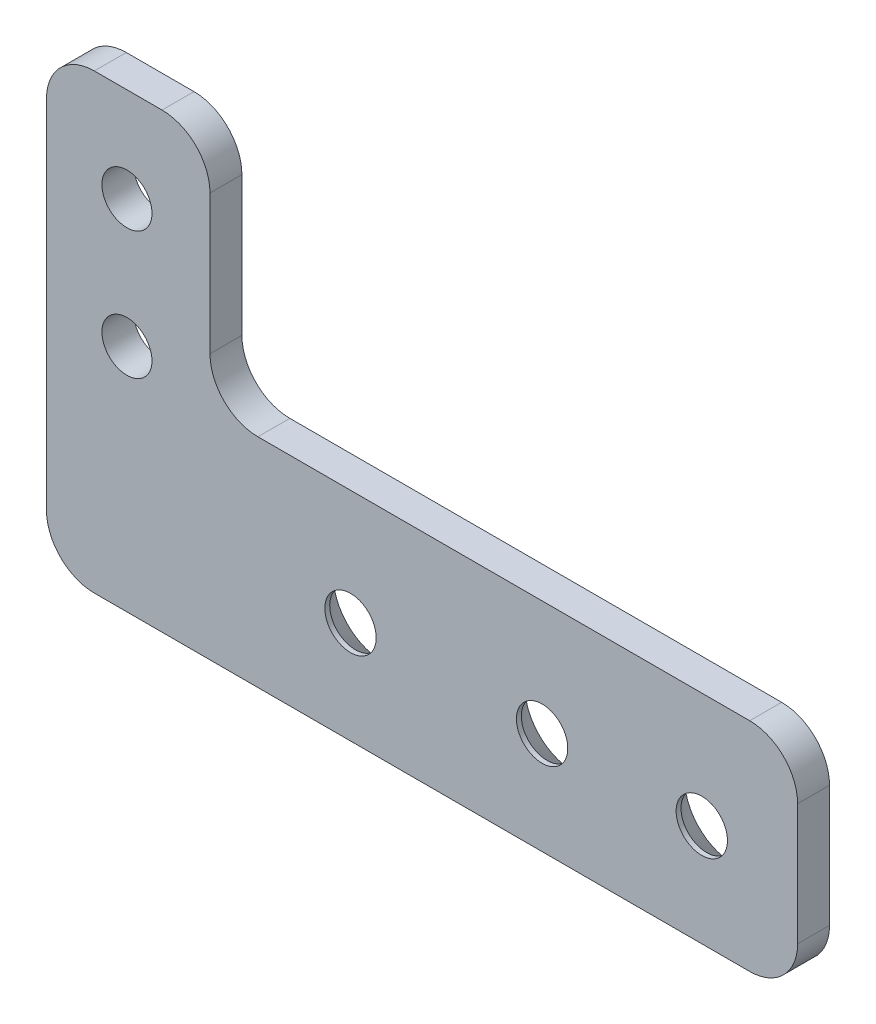
ISO-10303-21;
HEADER;
FILE_DESCRIPTION(('STEP AP214'),'2;1');
FILE_NAME('part.step','',(''),(''),'','','');
FILE_SCHEMA(('AUTOMOTIVE_DESIGN { 1 0 10303 214 1 1 1 1 }'));
ENDSEC;
DATA;
#1=APPLICATION_CONTEXT('core data for automotive mechanical design processes');
#2=APPLICATION_PROTOCOL_DEFINITION('international standard','automotive_design',2000,#1);
#3=PRODUCT_CONTEXT('',#1,'mechanical');
#4=PRODUCT('Part','Part','',(#3));
#5=PRODUCT_RELATED_PRODUCT_CATEGORY('part','',(#4));
#6=PRODUCT_DEFINITION_FORMATION('','',#4);
#7=PRODUCT_DEFINITION_CONTEXT('part definition',#1,'design');
#8=PRODUCT_DEFINITION('design','',#6,#7);
#9=PRODUCT_DEFINITION_SHAPE('','',#8);
#10=(LENGTH_UNIT() NAMED_UNIT(*) SI_UNIT(.MILLI.,.METRE.));
#11=(NAMED_UNIT(*) PLANE_ANGLE_UNIT() SI_UNIT($,.RADIAN.));
#12=(NAMED_UNIT(*) SI_UNIT($,.STERADIAN.) SOLID_ANGLE_UNIT());
#13=UNCERTAINTY_MEASURE_WITH_UNIT(LENGTH_MEASURE(1.E-05),#10,'distance_accuracy_value','');
#14=(GEOMETRIC_REPRESENTATION_CONTEXT(3) GLOBAL_UNCERTAINTY_ASSIGNED_CONTEXT((#13)) GLOBAL_UNIT_ASSIGNED_CONTEXT((#10,
#11,#12)) REPRESENTATION_CONTEXT('',''));
#15=CARTESIAN_POINT('',(0.,0.,0.));
#16=DIRECTION('',(0.,0.,1.));
#17=DIRECTION('',(1.,0.,0.));
#18=AXIS2_PLACEMENT_3D('',#15,#16,#17);
#19=CARTESIAN_POINT('',(0.,0.,0.));
#20=DIRECTION('',(0.,0.,1.));
#21=DIRECTION('',(1.,0.,0.));
#22=AXIS2_PLACEMENT_3D('',#19,#20,#21);
#23=PLANE('',#22);
#24=CARTESIAN_POINT('',(15.875,-11.049,0.));
#25=DIRECTION('',(0.,0.,-1.));
#26=DIRECTION('',(-1.,0.,0.));
#27=AXIS2_PLACEMENT_3D('',#24,#25,#26);
#28=CIRCLE('',#27,4.8895);
#29=CARTESIAN_POINT('',(10.9855,-11.049,0.));
#30=VERTEX_POINT('',#29);
#31=EDGE_CURVE('E495',#30,#30,#28,.T.);
#32=ORIENTED_EDGE('',*,*,#31,.F.);
#33=EDGE_LOOP('',(#32));
#34=FACE_BOUND('',#33,.T.);
#35=CARTESIAN_POINT('',(-3.17499999999997,-11.049,0.));
#36=DIRECTION('',(0.,0.,-1.));
#37=DIRECTION('',(-1.,0.,0.));
#38=AXIS2_PLACEMENT_3D('',#35,#36,#37);
#39=CIRCLE('',#38,4.8895);
#40=CARTESIAN_POINT('',(-8.06449999999997,-11.049,0.));
#41=VERTEX_POINT('',#40);
#42=EDGE_CURVE('E507',#41,#41,#39,.T.);
#43=ORIENTED_EDGE('',*,*,#42,.F.);
#44=EDGE_LOOP('',(#43));
#45=FACE_BOUND('',#44,.T.);
#46=CARTESIAN_POINT('',(-25.4,14.351,0.));
#47=DIRECTION('',(0.,0.,1.));
#48=DIRECTION('',(1.,0.,0.));
#49=AXIS2_PLACEMENT_3D('',#46,#47,#48);
#50=CIRCLE('',#49,2.4892);
#51=CARTESIAN_POINT('',(-22.9108,14.351,0.));
#52=VERTEX_POINT('',#51);
#53=EDGE_CURVE('E254',#52,#52,#50,.T.);
#54=ORIENTED_EDGE('',*,*,#53,.T.);
#55=EDGE_LOOP('',(#54));
#56=FACE_BOUND('',#55,.T.);
#57=CARTESIAN_POINT('',(-25.4,1.651,0.));
#58=DIRECTION('',(0.,0.,1.));
#59=DIRECTION('',(1.,0.,0.));
#60=AXIS2_PLACEMENT_3D('',#57,#58,#59);
#61=CIRCLE('',#60,2.4892);
#62=CARTESIAN_POINT('',(-22.9108,1.651,0.));
#63=VERTEX_POINT('',#62);
#64=EDGE_CURVE('E153',#63,#63,#61,.T.);
#65=ORIENTED_EDGE('',*,*,#64,.T.);
#66=EDGE_LOOP('',(#65));
#67=FACE_BOUND('',#66,.T.);
#68=DIRECTION('',(0.,1.,0.));
#69=VECTOR('',#68,1.);
#70=CARTESIAN_POINT('',(-33.401,0.,0.));
#71=LINE('',#70,#69);
#72=CARTESIAN_POINT('',(-33.401,-16.4465,0.));
#73=VERTEX_POINT('',#72);
#74=CARTESIAN_POINT('',(-33.401,18.9865,0.));
#75=VERTEX_POINT('',#74);
#76=EDGE_CURVE('E134',#73,#75,#71,.T.);
#77=ORIENTED_EDGE('',*,*,#76,.T.);
#78=CARTESIAN_POINT('',(-28.6385,18.9865,0.));
#79=DIRECTION('',(0.,0.,1.));
#80=DIRECTION('',(1.,0.,0.));
#81=AXIS2_PLACEMENT_3D('',#78,#79,#80);
#82=CIRCLE('',#81,4.7625);
#83=CARTESIAN_POINT('',(-28.6385,23.749,0.));
#84=VERTEX_POINT('',#83);
#85=EDGE_CURVE('E178',#75,#84,#82,.F.);
#86=ORIENTED_EDGE('',*,*,#85,.T.);
#87=DIRECTION('',(1.,0.,0.));
#88=VECTOR('',#87,1.);
#89=CARTESIAN_POINT('',(0.,23.749,0.));
#90=LINE('',#89,#88);
#91=CARTESIAN_POINT('',(-21.9075,23.749,0.));
#92=VERTEX_POINT('',#91);
#93=EDGE_CURVE('E167',#84,#92,#90,.T.);
#94=ORIENTED_EDGE('',*,*,#93,.T.);
#95=CARTESIAN_POINT('',(-21.9075,18.9865,0.));
#96=DIRECTION('',(0.,0.,1.));
#97=DIRECTION('',(1.,0.,0.));
#98=AXIS2_PLACEMENT_3D('',#95,#96,#97);
#99=CIRCLE('',#98,4.7625);
#100=CARTESIAN_POINT('',(-17.145,18.9865,0.));
#101=VERTEX_POINT('',#100);
#102=EDGE_CURVE('E175',#92,#101,#99,.F.);
#103=ORIENTED_EDGE('',*,*,#102,.T.);
#104=DIRECTION('',(0.,-1.,0.));
#105=VECTOR('',#104,1.);
#106=CARTESIAN_POINT('',(-17.145,0.,0.));
#107=LINE('',#106,#105);
#108=CARTESIAN_POINT('',(-17.145,5.1435,0.));
#109=VERTEX_POINT('',#108);
#110=EDGE_CURVE('E232',#101,#109,#107,.T.);
#111=ORIENTED_EDGE('',*,*,#110,.T.);
#112=CARTESIAN_POINT('',(-12.3825,5.1435,0.));
#113=DIRECTION('',(0.,0.,1.));
#114=DIRECTION('',(1.,0.,0.));
#115=AXIS2_PLACEMENT_3D('',#112,#113,#114);
#116=CIRCLE('',#115,4.7625);
#117=CARTESIAN_POINT('',(-12.3825,0.380999999999996,0.));
#118=VERTEX_POINT('',#117);
#119=EDGE_CURVE('E50',#109,#118,#116,.T.);
#120=ORIENTED_EDGE('',*,*,#119,.T.);
#121=DIRECTION('',(-1.,0.,0.));
#122=VECTOR('',#121,1.);
#123=CARTESIAN_POINT('',(0.,0.380999999999998,0.));
#124=LINE('',#123,#122);
#125=CARTESIAN_POINT('',(36.5125,0.381000000000002,0.));
#126=VERTEX_POINT('',#125);
#127=EDGE_CURVE('E231',#126,#118,#124,.T.);
#128=ORIENTED_EDGE('',*,*,#127,.F.);
#129=CARTESIAN_POINT('',(36.5125,-4.3815,0.));
#130=DIRECTION('',(0.,0.,1.));
#131=DIRECTION('',(1.,0.,0.));
#132=AXIS2_PLACEMENT_3D('',#129,#130,#131);
#133=CIRCLE('',#132,4.7625);
#134=CARTESIAN_POINT('',(41.275,-4.3815,0.));
#135=VERTEX_POINT('',#134);
#136=EDGE_CURVE('E172',#126,#135,#133,.F.);
#137=ORIENTED_EDGE('',*,*,#136,.T.);
#138=DIRECTION('',(0.,1.,0.));
#139=VECTOR('',#138,1.);
#140=CARTESIAN_POINT('',(41.275,0.,0.));
#141=LINE('',#140,#139);
#142=CARTESIAN_POINT('',(41.275,-16.4465,0.));
#143=VERTEX_POINT('',#142);
#144=EDGE_CURVE('E241',#143,#135,#141,.T.);
#145=ORIENTED_EDGE('',*,*,#144,.F.);
#146=CARTESIAN_POINT('',(36.5125,-16.4465,0.));
#147=DIRECTION('',(0.,0.,1.));
#148=DIRECTION('',(1.,0.,0.));
#149=AXIS2_PLACEMENT_3D('',#146,#147,#148);
#150=CIRCLE('',#149,4.7625);
#151=CARTESIAN_POINT('',(36.5125,-21.209,0.));
#152=VERTEX_POINT('',#151);
#153=EDGE_CURVE('E142',#143,#152,#150,.F.);
#154=ORIENTED_EDGE('',*,*,#153,.T.);
#155=DIRECTION('',(1.,0.,0.));
#156=VECTOR('',#155,1.);
#157=CARTESIAN_POINT('',(0.,-21.209,0.));
#158=LINE('',#157,#156);
#159=CARTESIAN_POINT('',(-28.6385,-21.209,0.));
#160=VERTEX_POINT('',#159);
#161=EDGE_CURVE('E136',#160,#152,#158,.T.);
#162=ORIENTED_EDGE('',*,*,#161,.F.);
#163=CARTESIAN_POINT('',(-28.6385,-16.4465,0.));
#164=DIRECTION('',(0.,0.,1.));
#165=DIRECTION('',(1.,0.,0.));
#166=AXIS2_PLACEMENT_3D('',#163,#164,#165);
#167=CIRCLE('',#166,4.7625);
#168=EDGE_CURVE('E131',#160,#73,#167,.F.);
#169=ORIENTED_EDGE('',*,*,#168,.T.);
#170=EDGE_LOOP('',(#77,#86,#94,#103,#111,#120,#128,#137,#145,#154,#162,#169));
#171=FACE_BOUND('',#170,.T.);
#172=CARTESIAN_POINT('',(31.75,-11.049,0.));
#173=DIRECTION('',(0.,0.,-1.));
#174=DIRECTION('',(-1.,0.,0.));
#175=AXIS2_PLACEMENT_3D('',#172,#173,#174);
#176=CIRCLE('',#175,4.8895);
#177=CARTESIAN_POINT('',(26.8605,-11.049,0.));
#178=VERTEX_POINT('',#177);
#179=EDGE_CURVE('E485',#178,#178,#176,.T.);
#180=ORIENTED_EDGE('',*,*,#179,.F.);
#181=EDGE_LOOP('',(#180));
#182=FACE_BOUND('',#181,.T.);
#183=ADVANCED_FACE('F41',(#34,#45,#56,#67,#171,#182),#23,.F.);
#184=CARTESIAN_POINT('',(-33.401,0.,3.175));
#185=DIRECTION('',(-1.,0.,0.));
#186=DIRECTION('',(0.,0.,1.));
#187=AXIS2_PLACEMENT_3D('',#184,#185,#186);
#188=PLANE('',#187);
#189=DIRECTION('',(0.,1.,0.));
#190=VECTOR('',#189,1.);
#191=CARTESIAN_POINT('',(-33.401,0.,3.175));
#192=LINE('',#191,#190);
#193=CARTESIAN_POINT('',(-33.401,-16.4465,3.175));
#194=VERTEX_POINT('',#193);
#195=CARTESIAN_POINT('',(-33.401,18.9865,3.175));
#196=VERTEX_POINT('',#195);
#197=EDGE_CURVE('E279',#194,#196,#192,.T.);
#198=ORIENTED_EDGE('',*,*,#197,.T.);
#199=DIRECTION('',(0.,0.,-1.));
#200=VECTOR('',#199,1.);
#201=CARTESIAN_POINT('',(-33.401,18.9865,3.175));
#202=LINE('',#201,#200);
#203=EDGE_CURVE('E143',#196,#75,#202,.T.);
#204=ORIENTED_EDGE('',*,*,#203,.T.);
#205=ORIENTED_EDGE('',*,*,#76,.F.);
#206=DIRECTION('',(0.,0.,-1.));
#207=VECTOR('',#206,1.);
#208=CARTESIAN_POINT('',(-33.401,-16.4465,3.175));
#209=LINE('',#208,#207);
#210=EDGE_CURVE('E149',#73,#194,#209,.F.);
#211=ORIENTED_EDGE('',*,*,#210,.T.);
#212=EDGE_LOOP('',(#198,#204,#205,#211));
#213=FACE_BOUND('',#212,.T.);
#214=ADVANCED_FACE('F148',(#213),#188,.T.);
#215=CARTESIAN_POINT('',(0.,-21.209,3.175));
#216=DIRECTION('',(0.,1.,0.));
#217=DIRECTION('',(0.,0.,1.));
#218=AXIS2_PLACEMENT_3D('',#215,#216,#217);
#219=PLANE('',#218);
#220=ORIENTED_EDGE('',*,*,#161,.T.);
#221=DIRECTION('',(0.,0.,-1.));
#222=VECTOR('',#221,1.);
#223=CARTESIAN_POINT('',(36.5125,-21.209,3.175));
#224=LINE('',#223,#222);
#225=CARTESIAN_POINT('',(36.5125,-21.209,3.175));
#226=VERTEX_POINT('',#225);
#227=EDGE_CURVE('E225',#152,#226,#224,.F.);
#228=ORIENTED_EDGE('',*,*,#227,.T.);
#229=DIRECTION('',(1.,0.,0.));
#230=VECTOR('',#229,1.);
#231=CARTESIAN_POINT('',(0.,-21.209,3.175));
#232=LINE('',#231,#230);
#233=CARTESIAN_POINT('',(-28.6385,-21.209,3.175));
#234=VERTEX_POINT('',#233);
#235=EDGE_CURVE('E286',#234,#226,#232,.T.);
#236=ORIENTED_EDGE('',*,*,#235,.F.);
#237=DIRECTION('',(0.,0.,-1.));
#238=VECTOR('',#237,1.);
#239=CARTESIAN_POINT('',(-28.6385,-21.209,0.));
#240=LINE('',#239,#238);
#241=EDGE_CURVE('E222',#234,#160,#240,.T.);
#242=ORIENTED_EDGE('',*,*,#241,.T.);
#243=EDGE_LOOP('',(#220,#228,#236,#242));
#244=FACE_BOUND('',#243,.T.);
#245=ADVANCED_FACE('F307',(#244),#219,.F.);
#246=CARTESIAN_POINT('',(41.275,0.,3.175));
#247=DIRECTION('',(-1.,0.,0.));
#248=DIRECTION('',(0.,0.,1.));
#249=AXIS2_PLACEMENT_3D('',#246,#247,#248);
#250=PLANE('',#249);
#251=ORIENTED_EDGE('',*,*,#144,.T.);
#252=DIRECTION('',(0.,0.,-1.));
#253=VECTOR('',#252,1.);
#254=CARTESIAN_POINT('',(41.275,-4.3815,3.175));
#255=LINE('',#254,#253);
#256=CARTESIAN_POINT('',(41.275,-4.3815,3.175));
#257=VERTEX_POINT('',#256);
#258=EDGE_CURVE('E219',#135,#257,#255,.F.);
#259=ORIENTED_EDGE('',*,*,#258,.T.);
#260=DIRECTION('',(0.,1.,0.));
#261=VECTOR('',#260,1.);
#262=CARTESIAN_POINT('',(41.275,0.,3.175));
#263=LINE('',#262,#261);
#264=CARTESIAN_POINT('',(41.275,-16.4465,3.175));
#265=VERTEX_POINT('',#264);
#266=EDGE_CURVE('E250',#265,#257,#263,.T.);
#267=ORIENTED_EDGE('',*,*,#266,.F.);
#268=DIRECTION('',(0.,0.,-1.));
#269=VECTOR('',#268,1.);
#270=CARTESIAN_POINT('',(41.275,-16.4465,3.175));
#271=LINE('',#270,#269);
#272=EDGE_CURVE('E215',#265,#143,#271,.T.);
#273=ORIENTED_EDGE('',*,*,#272,.T.);
#274=EDGE_LOOP('',(#251,#259,#267,#273));
#275=FACE_BOUND('',#274,.T.);
#276=ADVANCED_FACE('F302',(#275),#250,.F.);
#277=CARTESIAN_POINT('',(0.,0.380999999999998,3.175));
#278=DIRECTION('',(0.,-1.,0.));
#279=DIRECTION('',(1.,0.,0.));
#280=AXIS2_PLACEMENT_3D('',#277,#278,#279);
#281=PLANE('',#280);
#282=ORIENTED_EDGE('',*,*,#127,.T.);
#283=DIRECTION('',(0.,0.,-1.));
#284=VECTOR('',#283,1.);
#285=CARTESIAN_POINT('',(-12.3825,0.380999999999996,3.175));
#286=LINE('',#285,#284);
#287=CARTESIAN_POINT('',(-12.3825,0.380999999999996,3.175));
#288=VERTEX_POINT('',#287);
#289=EDGE_CURVE('E212',#118,#288,#286,.F.);
#290=ORIENTED_EDGE('',*,*,#289,.T.);
#291=DIRECTION('',(-1.,0.,0.));
#292=VECTOR('',#291,1.);
#293=CARTESIAN_POINT('',(0.,0.380999999999998,3.175));
#294=LINE('',#293,#292);
#295=CARTESIAN_POINT('',(36.5125,0.381000000000002,3.175));
#296=VERTEX_POINT('',#295);
#297=EDGE_CURVE('E247',#296,#288,#294,.T.);
#298=ORIENTED_EDGE('',*,*,#297,.F.);
#299=DIRECTION('',(0.,0.,-1.));
#300=VECTOR('',#299,1.);
#301=CARTESIAN_POINT('',(36.5125,0.381000000000002,3.175));
#302=LINE('',#301,#300);
#303=EDGE_CURVE('E208',#296,#126,#302,.T.);
#304=ORIENTED_EDGE('',*,*,#303,.T.);
#305=EDGE_LOOP('',(#282,#290,#298,#304));
#306=FACE_BOUND('',#305,.T.);
#307=ADVANCED_FACE('F237',(#306),#281,.F.);
#308=CARTESIAN_POINT('',(-17.145,0.,3.175));
#309=DIRECTION('',(1.,0.,0.));
#310=DIRECTION('',(0.,0.,-1.));
#311=AXIS2_PLACEMENT_3D('',#308,#309,#310);
#312=PLANE('',#311);
#313=ORIENTED_EDGE('',*,*,#110,.F.);
#314=DIRECTION('',(0.,0.,-1.));
#315=VECTOR('',#314,1.);
#316=CARTESIAN_POINT('',(-17.145,18.9865,3.175));
#317=LINE('',#316,#315);
#318=CARTESIAN_POINT('',(-17.145,18.9865,3.175));
#319=VERTEX_POINT('',#318);
#320=EDGE_CURVE('E62',#101,#319,#317,.F.);
#321=ORIENTED_EDGE('',*,*,#320,.T.);
#322=DIRECTION('',(0.,-1.,0.));
#323=VECTOR('',#322,1.);
#324=CARTESIAN_POINT('',(-17.145,0.,3.175));
#325=LINE('',#324,#323);
#326=CARTESIAN_POINT('',(-17.145,5.1435,3.175));
#327=VERTEX_POINT('',#326);
#328=EDGE_CURVE('E164',#319,#327,#325,.T.);
#329=ORIENTED_EDGE('',*,*,#328,.T.);
#330=DIRECTION('',(0.,0.,-1.));
#331=VECTOR('',#330,1.);
#332=CARTESIAN_POINT('',(-17.145,5.1435,3.175));
#333=LINE('',#332,#331);
#334=EDGE_CURVE('E202',#327,#109,#333,.T.);
#335=ORIENTED_EDGE('',*,*,#334,.T.);
#336=EDGE_LOOP('',(#313,#321,#329,#335));
#337=FACE_BOUND('',#336,.T.);
#338=ADVANCED_FACE('F244',(#337),#312,.T.);
#339=CARTESIAN_POINT('',(-25.4,1.651,3.175));
#340=DIRECTION('',(0.,0.,-1.));
#341=DIRECTION('',(-1.,0.,0.));
#342=AXIS2_PLACEMENT_3D('',#339,#340,#341);
#343=CYLINDRICAL_SURFACE('',#342,2.4892);
#344=CARTESIAN_POINT('',(-25.4,1.651,3.175));
#345=DIRECTION('',(0.,0.,1.));
#346=DIRECTION('',(1.,0.,0.));
#347=AXIS2_PLACEMENT_3D('',#344,#345,#346);
#348=CIRCLE('',#347,2.4892);
#349=CARTESIAN_POINT('',(-22.9108,1.651,3.175));
#350=VERTEX_POINT('',#349);
#351=EDGE_CURVE('E273',#350,#350,#348,.T.);
#352=ORIENTED_EDGE('',*,*,#351,.T.);
#353=EDGE_LOOP('',(#352));
#354=FACE_BOUND('',#353,.T.);
#355=ORIENTED_EDGE('',*,*,#64,.F.);
#356=EDGE_LOOP('',(#355));
#357=FACE_BOUND('',#356,.T.);
#358=ADVANCED_FACE('F343',(#354,#357),#343,.F.);
#359=CARTESIAN_POINT('',(-25.4,14.351,3.175));
#360=DIRECTION('',(0.,0.,-1.));
#361=DIRECTION('',(-1.,0.,0.));
#362=AXIS2_PLACEMENT_3D('',#359,#360,#361);
#363=CYLINDRICAL_SURFACE('',#362,2.4892);
#364=CARTESIAN_POINT('',(-25.4,14.351,3.175));
#365=DIRECTION('',(0.,0.,1.));
#366=DIRECTION('',(1.,0.,0.));
#367=AXIS2_PLACEMENT_3D('',#364,#365,#366);
#368=CIRCLE('',#367,2.4892);
#369=CARTESIAN_POINT('',(-22.9108,14.351,3.175));
#370=VERTEX_POINT('',#369);
#371=EDGE_CURVE('E269',#370,#370,#368,.T.);
#372=ORIENTED_EDGE('',*,*,#371,.T.);
#373=EDGE_LOOP('',(#372));
#374=FACE_BOUND('',#373,.T.);
#375=ORIENTED_EDGE('',*,*,#53,.F.);
#376=EDGE_LOOP('',(#375));
#377=FACE_BOUND('',#376,.T.);
#378=ADVANCED_FACE('F340',(#374,#377),#363,.F.);
#379=CARTESIAN_POINT('',(0.,23.749,3.175));
#380=DIRECTION('',(0.,1.,0.));
#381=DIRECTION('',(-1.,0.,0.));
#382=AXIS2_PLACEMENT_3D('',#379,#380,#381);
#383=PLANE('',#382);
#384=ORIENTED_EDGE('',*,*,#93,.F.);
#385=DIRECTION('',(0.,0.,-1.));
#386=VECTOR('',#385,1.);
#387=CARTESIAN_POINT('',(-28.6385,23.749,3.175));
#388=LINE('',#387,#386);
#389=CARTESIAN_POINT('',(-28.6385,23.749,3.175));
#390=VERTEX_POINT('',#389);
#391=EDGE_CURVE('E185',#84,#390,#388,.F.);
#392=ORIENTED_EDGE('',*,*,#391,.T.);
#393=DIRECTION('',(1.,0.,0.));
#394=VECTOR('',#393,1.);
#395=CARTESIAN_POINT('',(0.,23.749,3.175));
#396=LINE('',#395,#394);
#397=CARTESIAN_POINT('',(-21.9075,23.749,3.175));
#398=VERTEX_POINT('',#397);
#399=EDGE_CURVE('E158',#390,#398,#396,.T.);
#400=ORIENTED_EDGE('',*,*,#399,.T.);
#401=DIRECTION('',(0.,0.,-1.));
#402=VECTOR('',#401,1.);
#403=CARTESIAN_POINT('',(-21.9075,23.749,3.175));
#404=LINE('',#403,#402);
#405=EDGE_CURVE('E181',#398,#92,#404,.T.);
#406=ORIENTED_EDGE('',*,*,#405,.T.);
#407=EDGE_LOOP('',(#384,#392,#400,#406));
#408=FACE_BOUND('',#407,.T.);
#409=ADVANCED_FACE('F314',(#408),#383,.T.);
#410=CARTESIAN_POINT('',(0.,0.,3.175));
#411=DIRECTION('',(0.,0.,1.));
#412=DIRECTION('',(1.,0.,0.));
#413=AXIS2_PLACEMENT_3D('',#410,#411,#412);
#414=PLANE('',#413);
#415=CARTESIAN_POINT('',(31.75,-11.049,3.175));
#416=DIRECTION('',(0.,0.,-1.));
#417=DIRECTION('',(-1.,0.,0.));
#418=AXIS2_PLACEMENT_3D('',#415,#416,#417);
#419=CIRCLE('',#418,2.5527);
#420=CARTESIAN_POINT('',(29.1973,-11.049,3.175));
#421=VERTEX_POINT('',#420);
#422=EDGE_CURVE('E489',#421,#421,#419,.T.);
#423=ORIENTED_EDGE('',*,*,#422,.T.);
#424=EDGE_LOOP('',(#423));
#425=FACE_BOUND('',#424,.T.);
#426=CARTESIAN_POINT('',(15.875,-11.049,3.175));
#427=DIRECTION('',(0.,0.,-1.));
#428=DIRECTION('',(-1.,0.,0.));
#429=AXIS2_PLACEMENT_3D('',#426,#427,#428);
#430=CIRCLE('',#429,2.5527);
#431=CARTESIAN_POINT('',(13.3223,-11.049,3.175));
#432=VERTEX_POINT('',#431);
#433=EDGE_CURVE('E503',#432,#432,#430,.T.);
#434=ORIENTED_EDGE('',*,*,#433,.T.);
#435=EDGE_LOOP('',(#434));
#436=FACE_BOUND('',#435,.T.);
#437=CARTESIAN_POINT('',(-3.17499999999997,-11.049,3.175));
#438=DIRECTION('',(0.,0.,-1.));
#439=DIRECTION('',(-1.,0.,0.));
#440=AXIS2_PLACEMENT_3D('',#437,#438,#439);
#441=CIRCLE('',#440,2.5527);
#442=CARTESIAN_POINT('',(-5.72769999999997,-11.049,3.175));
#443=VERTEX_POINT('',#442);
#444=EDGE_CURVE('E258',#443,#443,#441,.T.);
#445=ORIENTED_EDGE('',*,*,#444,.T.);
#446=EDGE_LOOP('',(#445));
#447=FACE_BOUND('',#446,.T.);
#448=ORIENTED_EDGE('',*,*,#371,.F.);
#449=EDGE_LOOP('',(#448));
#450=FACE_BOUND('',#449,.T.);
#451=ORIENTED_EDGE('',*,*,#351,.F.);
#452=EDGE_LOOP('',(#451));
#453=FACE_BOUND('',#452,.T.);
#454=ORIENTED_EDGE('',*,*,#399,.F.);
#455=CARTESIAN_POINT('',(-28.6385,18.9865,3.175));
#456=DIRECTION('',(0.,0.,1.));
#457=DIRECTION('',(1.,0.,0.));
#458=AXIS2_PLACEMENT_3D('',#455,#456,#457);
#459=CIRCLE('',#458,4.7625);
#460=EDGE_CURVE('E199',#390,#196,#459,.T.);
#461=ORIENTED_EDGE('',*,*,#460,.T.);
#462=ORIENTED_EDGE('',*,*,#197,.F.);
#463=CARTESIAN_POINT('',(-28.6385,-16.4465,3.175));
#464=DIRECTION('',(0.,0.,1.));
#465=DIRECTION('',(1.,0.,0.));
#466=AXIS2_PLACEMENT_3D('',#463,#464,#465);
#467=CIRCLE('',#466,4.7625);
#468=EDGE_CURVE('E156',#194,#234,#467,.T.);
#469=ORIENTED_EDGE('',*,*,#468,.T.);
#470=ORIENTED_EDGE('',*,*,#235,.T.);
#471=CARTESIAN_POINT('',(36.5125,-16.4465,3.175));
#472=DIRECTION('',(0.,0.,1.));
#473=DIRECTION('',(1.,0.,0.));
#474=AXIS2_PLACEMENT_3D('',#471,#472,#473);
#475=CIRCLE('',#474,4.7625);
#476=EDGE_CURVE('E190',#226,#265,#475,.T.);
#477=ORIENTED_EDGE('',*,*,#476,.T.);
#478=ORIENTED_EDGE('',*,*,#266,.T.);
#479=CARTESIAN_POINT('',(36.5125,-4.3815,3.175));
#480=DIRECTION('',(0.,0.,1.));
#481=DIRECTION('',(1.,0.,0.));
#482=AXIS2_PLACEMENT_3D('',#479,#480,#481);
#483=CIRCLE('',#482,4.7625);
#484=EDGE_CURVE('E193',#257,#296,#483,.T.);
#485=ORIENTED_EDGE('',*,*,#484,.T.);
#486=ORIENTED_EDGE('',*,*,#297,.T.);
#487=CARTESIAN_POINT('',(-12.3825,5.1435,3.175));
#488=DIRECTION('',(0.,0.,1.));
#489=DIRECTION('',(1.,0.,0.));
#490=AXIS2_PLACEMENT_3D('',#487,#488,#489);
#491=CIRCLE('',#490,4.7625);
#492=EDGE_CURVE('E11',#288,#327,#491,.F.);
#493=ORIENTED_EDGE('',*,*,#492,.T.);
#494=ORIENTED_EDGE('',*,*,#328,.F.);
#495=CARTESIAN_POINT('',(-21.9075,18.9865,3.175));
#496=DIRECTION('',(0.,0.,1.));
#497=DIRECTION('',(1.,0.,0.));
#498=AXIS2_PLACEMENT_3D('',#495,#496,#497);
#499=CIRCLE('',#498,4.7625);
#500=EDGE_CURVE('E196',#319,#398,#499,.T.);
#501=ORIENTED_EDGE('',*,*,#500,.T.);
#502=EDGE_LOOP('',(#454,#461,#462,#469,#470,#477,#478,#485,#486,#493,#494,#501));
#503=FACE_BOUND('',#502,.T.);
#504=ADVANCED_FACE('F294',(#425,#436,#447,#450,#453,#503),#414,.T.);
#505=CARTESIAN_POINT('',(-28.6385,18.9865,3.175));
#506=DIRECTION('',(0.,0.,-1.));
#507=DIRECTION('',(-1.,0.,0.));
#508=AXIS2_PLACEMENT_3D('',#505,#506,#507);
#509=CYLINDRICAL_SURFACE('',#508,4.7625);
#510=ORIENTED_EDGE('',*,*,#460,.F.);
#511=ORIENTED_EDGE('',*,*,#391,.F.);
#512=ORIENTED_EDGE('',*,*,#85,.F.);
#513=ORIENTED_EDGE('',*,*,#203,.F.);
#514=EDGE_LOOP('',(#510,#511,#512,#513));
#515=FACE_BOUND('',#514,.T.);
#516=ADVANCED_FACE('F311',(#515),#509,.T.);
#517=CARTESIAN_POINT('',(-21.9075,18.9865,3.175));
#518=DIRECTION('',(0.,0.,-1.));
#519=DIRECTION('',(-1.,0.,0.));
#520=AXIS2_PLACEMENT_3D('',#517,#518,#519);
#521=CYLINDRICAL_SURFACE('',#520,4.7625);
#522=ORIENTED_EDGE('',*,*,#500,.F.);
#523=ORIENTED_EDGE('',*,*,#320,.F.);
#524=ORIENTED_EDGE('',*,*,#102,.F.);
#525=ORIENTED_EDGE('',*,*,#405,.F.);
#526=EDGE_LOOP('',(#522,#523,#524,#525));
#527=FACE_BOUND('',#526,.T.);
#528=ADVANCED_FACE('F317',(#527),#521,.T.);
#529=CARTESIAN_POINT('',(-12.3825,5.1435,3.175));
#530=DIRECTION('',(0.,0.,-1.));
#531=DIRECTION('',(-1.,0.,0.));
#532=AXIS2_PLACEMENT_3D('',#529,#530,#531);
#533=CYLINDRICAL_SURFACE('',#532,4.7625);
#534=ORIENTED_EDGE('',*,*,#492,.F.);
#535=ORIENTED_EDGE('',*,*,#289,.F.);
#536=ORIENTED_EDGE('',*,*,#119,.F.);
#537=ORIENTED_EDGE('',*,*,#334,.F.);
#538=EDGE_LOOP('',(#534,#535,#536,#537));
#539=FACE_BOUND('',#538,.T.);
#540=ADVANCED_FACE('F243',(#539),#533,.F.);
#541=CARTESIAN_POINT('',(36.5125,-4.3815,3.175));
#542=DIRECTION('',(0.,0.,-1.));
#543=DIRECTION('',(-1.,0.,0.));
#544=AXIS2_PLACEMENT_3D('',#541,#542,#543);
#545=CYLINDRICAL_SURFACE('',#544,4.7625);
#546=ORIENTED_EDGE('',*,*,#484,.F.);
#547=ORIENTED_EDGE('',*,*,#258,.F.);
#548=ORIENTED_EDGE('',*,*,#136,.F.);
#549=ORIENTED_EDGE('',*,*,#303,.F.);
#550=EDGE_LOOP('',(#546,#547,#548,#549));
#551=FACE_BOUND('',#550,.T.);
#552=ADVANCED_FACE('F300',(#551),#545,.T.);
#553=CARTESIAN_POINT('',(36.5125,-16.4465,3.175));
#554=DIRECTION('',(0.,0.,-1.));
#555=DIRECTION('',(-1.,0.,0.));
#556=AXIS2_PLACEMENT_3D('',#553,#554,#555);
#557=CYLINDRICAL_SURFACE('',#556,4.7625);
#558=ORIENTED_EDGE('',*,*,#476,.F.);
#559=ORIENTED_EDGE('',*,*,#227,.F.);
#560=ORIENTED_EDGE('',*,*,#153,.F.);
#561=ORIENTED_EDGE('',*,*,#272,.F.);
#562=EDGE_LOOP('',(#558,#559,#560,#561));
#563=FACE_BOUND('',#562,.T.);
#564=ADVANCED_FACE('F304',(#563),#557,.T.);
#565=CARTESIAN_POINT('',(-28.6385,-16.4465,3.175));
#566=DIRECTION('',(0.,0.,1.));
#567=DIRECTION('',(1.,0.,0.));
#568=AXIS2_PLACEMENT_3D('',#565,#566,#567);
#569=CYLINDRICAL_SURFACE('',#568,4.7625);
#570=ORIENTED_EDGE('',*,*,#468,.F.);
#571=ORIENTED_EDGE('',*,*,#210,.F.);
#572=ORIENTED_EDGE('',*,*,#168,.F.);
#573=ORIENTED_EDGE('',*,*,#241,.F.);
#574=EDGE_LOOP('',(#570,#571,#572,#573));
#575=FACE_BOUND('',#574,.T.);
#576=ADVANCED_FACE('F43',(#575),#569,.T.);
#577=CARTESIAN_POINT('',(-3.17499999999997,-11.049,0.));
#578=DIRECTION('',(0.,0.,-1.));
#579=DIRECTION('',(-1.,0.,0.));
#580=AXIS2_PLACEMENT_3D('',#577,#578,#579);
#581=CYLINDRICAL_SURFACE('',#580,2.55269999999999);
#582=ORIENTED_EDGE('',*,*,#444,.F.);
#583=EDGE_LOOP('',(#582));
#584=FACE_BOUND('',#583,.T.);
#585=CARTESIAN_POINT('',(-3.17499999999997,-11.049,2.68818089399404));
#586=DIRECTION('',(0.,0.,-1.));
#587=DIRECTION('',(-1.,0.,0.));
#588=AXIS2_PLACEMENT_3D('',#585,#586,#587);
#589=CIRCLE('',#588,2.55269999999999);
#590=CARTESIAN_POINT('',(-5.72769999999995,-11.049,2.68818089399404));
#591=VERTEX_POINT('',#590);
#592=EDGE_CURVE('E510',#591,#591,#589,.T.);
#593=ORIENTED_EDGE('',*,*,#592,.T.);
#594=EDGE_LOOP('',(#593));
#595=FACE_BOUND('',#594,.T.);
#596=ADVANCED_FACE('F414',(#584,#595),#581,.F.);
#597=CARTESIAN_POINT('',(-3.17499999999997,-11.049,0.));
#598=DIRECTION('',(0.,0.,-1.));
#599=DIRECTION('',(-1.,0.,0.));
#600=AXIS2_PLACEMENT_3D('',#597,#598,#599);
#601=CONICAL_SURFACE('',#600,4.8895,0.715584993317679);
#602=ORIENTED_EDGE('',*,*,#592,.F.);
#603=EDGE_LOOP('',(#602));
#604=FACE_BOUND('',#603,.T.);
#605=ORIENTED_EDGE('',*,*,#42,.T.);
#606=EDGE_LOOP('',(#605));
#607=FACE_BOUND('',#606,.T.);
#608=ADVANCED_FACE('F427',(#604,#607),#601,.F.);
#609=CARTESIAN_POINT('',(15.875,-11.049,0.));
#610=DIRECTION('',(0.,0.,-1.));
#611=DIRECTION('',(-1.,0.,0.));
#612=AXIS2_PLACEMENT_3D('',#609,#610,#611);
#613=CYLINDRICAL_SURFACE('',#612,2.55269999999999);
#614=ORIENTED_EDGE('',*,*,#433,.F.);
#615=EDGE_LOOP('',(#614));
#616=FACE_BOUND('',#615,.T.);
#617=CARTESIAN_POINT('',(15.875,-11.049,2.68818089399404));
#618=DIRECTION('',(0.,0.,-1.));
#619=DIRECTION('',(-1.,0.,0.));
#620=AXIS2_PLACEMENT_3D('',#617,#618,#619);
#621=CIRCLE('',#620,2.55269999999999);
#622=CARTESIAN_POINT('',(13.3223,-11.049,2.68818089399404));
#623=VERTEX_POINT('',#622);
#624=EDGE_CURVE('E499',#623,#623,#621,.T.);
#625=ORIENTED_EDGE('',*,*,#624,.T.);
#626=EDGE_LOOP('',(#625));
#627=FACE_BOUND('',#626,.T.);
#628=ADVANCED_FACE('F435',(#616,#627),#613,.F.);
#629=CARTESIAN_POINT('',(15.875,-11.049,0.));
#630=DIRECTION('',(0.,0.,-1.));
#631=DIRECTION('',(-1.,0.,0.));
#632=AXIS2_PLACEMENT_3D('',#629,#630,#631);
#633=CONICAL_SURFACE('',#632,4.8895,0.715584993317679);
#634=ORIENTED_EDGE('',*,*,#624,.F.);
#635=EDGE_LOOP('',(#634));
#636=FACE_BOUND('',#635,.T.);
#637=ORIENTED_EDGE('',*,*,#31,.T.);
#638=EDGE_LOOP('',(#637));
#639=FACE_BOUND('',#638,.T.);
#640=ADVANCED_FACE('F444',(#636,#639),#633,.F.);
#641=CARTESIAN_POINT('',(31.75,-11.049,0.));
#642=DIRECTION('',(0.,0.,-1.));
#643=DIRECTION('',(-1.,0.,0.));
#644=AXIS2_PLACEMENT_3D('',#641,#642,#643);
#645=CYLINDRICAL_SURFACE('',#644,2.55269999999999);
#646=ORIENTED_EDGE('',*,*,#422,.F.);
#647=EDGE_LOOP('',(#646));
#648=FACE_BOUND('',#647,.T.);
#649=CARTESIAN_POINT('',(31.75,-11.049,2.68818089399404));
#650=DIRECTION('',(0.,0.,-1.));
#651=DIRECTION('',(-1.,0.,0.));
#652=AXIS2_PLACEMENT_3D('',#649,#650,#651);
#653=CIRCLE('',#652,2.55269999999999);
#654=CARTESIAN_POINT('',(29.1973,-11.049,2.68818089399404));
#655=VERTEX_POINT('',#654);
#656=EDGE_CURVE('E482',#655,#655,#653,.T.);
#657=ORIENTED_EDGE('',*,*,#656,.T.);
#658=EDGE_LOOP('',(#657));
#659=FACE_BOUND('',#658,.T.);
#660=ADVANCED_FACE('F453',(#648,#659),#645,.F.);
#661=CARTESIAN_POINT('',(31.75,-11.049,0.));
#662=DIRECTION('',(0.,0.,-1.));
#663=DIRECTION('',(-1.,0.,0.));
#664=AXIS2_PLACEMENT_3D('',#661,#662,#663);
#665=CONICAL_SURFACE('',#664,4.8895,0.715584993317678);
#666=ORIENTED_EDGE('',*,*,#656,.F.);
#667=EDGE_LOOP('',(#666));
#668=FACE_BOUND('',#667,.T.);
#669=ORIENTED_EDGE('',*,*,#179,.T.);
#670=EDGE_LOOP('',(#669));
#671=FACE_BOUND('',#670,.T.);
#672=ADVANCED_FACE('F462',(#668,#671),#665,.F.);
#673=CLOSED_SHELL('',(#183,#214,#245,#276,#307,#338,#358,#378,#409,#504,#516,#528,#540,#552,
#564,#576,#596,#608,#628,#640,#660,#672));
#674=MANIFOLD_SOLID_BREP('B2',#673);
#675=ADVANCED_BREP_SHAPE_REPRESENTATION('',(#18,#674),#14);
#676=SHAPE_DEFINITION_REPRESENTATION(#9,#675);
ENDSEC;
END-ISO-10303-21;
